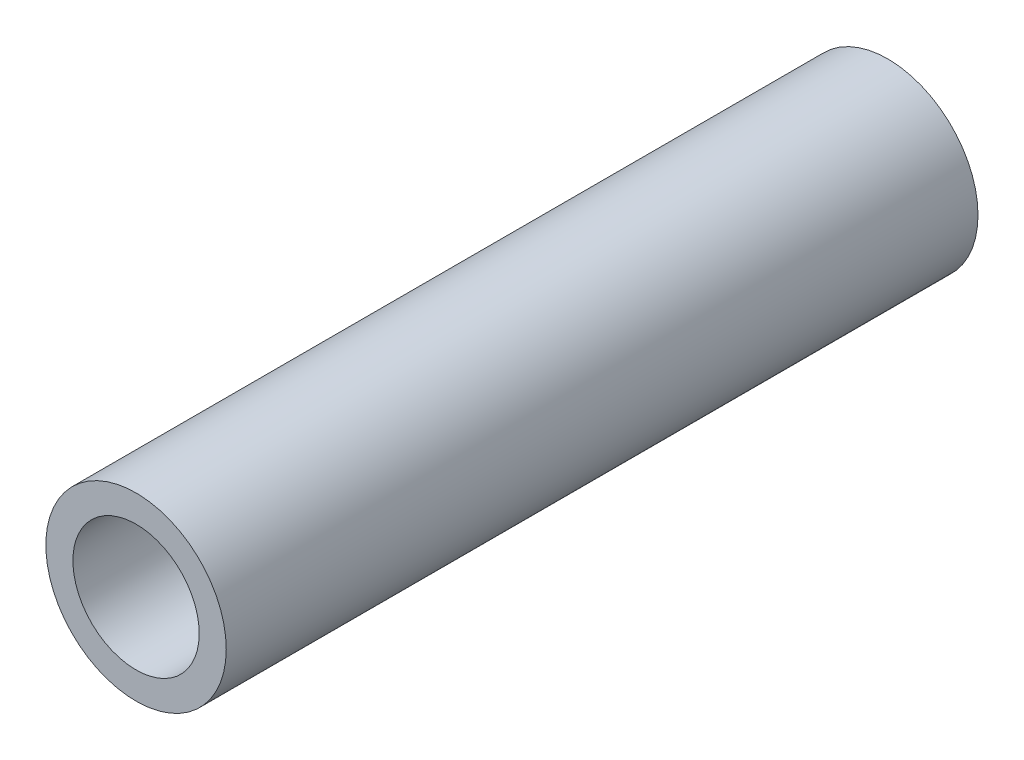
ISO-10303-21;
HEADER;
FILE_DESCRIPTION(('STEP AP214'),'2;1');
FILE_NAME('part.step','',(''),(''),'','','');
FILE_SCHEMA(('AUTOMOTIVE_DESIGN { 1 0 10303 214 1 1 1 1 }'));
ENDSEC;
DATA;
#1=APPLICATION_CONTEXT('core data for automotive mechanical design processes');
#2=APPLICATION_PROTOCOL_DEFINITION('international standard','automotive_design',2000,#1);
#3=PRODUCT_CONTEXT('',#1,'mechanical');
#4=PRODUCT('Part','Part','',(#3));
#5=PRODUCT_RELATED_PRODUCT_CATEGORY('part','',(#4));
#6=PRODUCT_DEFINITION_FORMATION('','',#4);
#7=PRODUCT_DEFINITION_CONTEXT('part definition',#1,'design');
#8=PRODUCT_DEFINITION('design','',#6,#7);
#9=PRODUCT_DEFINITION_SHAPE('','',#8);
#10=(LENGTH_UNIT() NAMED_UNIT(*) SI_UNIT(.MILLI.,.METRE.));
#11=(NAMED_UNIT(*) PLANE_ANGLE_UNIT() SI_UNIT($,.RADIAN.));
#12=(NAMED_UNIT(*) SI_UNIT($,.STERADIAN.) SOLID_ANGLE_UNIT());
#13=UNCERTAINTY_MEASURE_WITH_UNIT(LENGTH_MEASURE(1.E-05),#10,'distance_accuracy_value','');
#14=(GEOMETRIC_REPRESENTATION_CONTEXT(3) GLOBAL_UNCERTAINTY_ASSIGNED_CONTEXT((#13)) GLOBAL_UNIT_ASSIGNED_CONTEXT((#10,
#11,#12)) REPRESENTATION_CONTEXT('',''));
#15=CARTESIAN_POINT('',(0.,0.,0.));
#16=DIRECTION('',(0.,0.,1.));
#17=DIRECTION('',(1.,0.,0.));
#18=AXIS2_PLACEMENT_3D('',#15,#16,#17);
#19=CARTESIAN_POINT('',(0.,0.,0.));
#20=DIRECTION('',(0.,0.,1.));
#21=DIRECTION('',(-1.,0.,0.));
#22=AXIS2_PLACEMENT_3D('',#19,#20,#21);
#23=CYLINDRICAL_SURFACE('',#22,2.1);
#24=CARTESIAN_POINT('',(0.,0.,0.));
#25=DIRECTION('',(0.,0.,1.));
#26=DIRECTION('',(-1.,0.,0.));
#27=AXIS2_PLACEMENT_3D('',#24,#25,#26);
#28=CIRCLE('',#27,2.1);
#29=CARTESIAN_POINT('',(2.1,0.,0.));
#30=VERTEX_POINT('',#29);
#31=EDGE_CURVE('E39',#30,#30,#28,.T.);
#32=ORIENTED_EDGE('',*,*,#31,.F.);
#33=DIRECTION('',(0.,0.,1.));
#34=VECTOR('',#33,1.);
#35=CARTESIAN_POINT('',(2.1,0.,0.));
#36=LINE('',#35,#34);
#37=CARTESIAN_POINT('',(2.1,0.,25.));
#38=VERTEX_POINT('',#37);
#39=EDGE_CURVE('E10',#30,#38,#36,.T.);
#40=ORIENTED_EDGE('',*,*,#39,.T.);
#41=CARTESIAN_POINT('',(0.,0.,25.));
#42=DIRECTION('',(0.,0.,-1.));
#43=DIRECTION('',(-1.,0.,0.));
#44=AXIS2_PLACEMENT_3D('',#41,#42,#43);
#45=CIRCLE('',#44,2.1);
#46=EDGE_CURVE('E58',#38,#38,#45,.T.);
#47=ORIENTED_EDGE('',*,*,#46,.F.);
#48=ORIENTED_EDGE('',*,*,#39,.F.);
#49=EDGE_LOOP('',(#32,#40,#47,#48));
#50=FACE_BOUND('',#49,.T.);
#51=ADVANCED_FACE('F16',(#50),#23,.F.);
#52=CARTESIAN_POINT('',(0.,0.,0.));
#53=DIRECTION('',(0.,0.,1.));
#54=DIRECTION('',(-1.,0.,0.));
#55=AXIS2_PLACEMENT_3D('',#52,#53,#54);
#56=CYLINDRICAL_SURFACE('',#55,3.);
#57=CARTESIAN_POINT('',(0.,0.,25.));
#58=DIRECTION('',(0.,0.,1.));
#59=DIRECTION('',(-1.,0.,0.));
#60=AXIS2_PLACEMENT_3D('',#57,#58,#59);
#61=CIRCLE('',#60,3.);
#62=CARTESIAN_POINT('',(3.,0.,25.));
#63=VERTEX_POINT('',#62);
#64=EDGE_CURVE('E53',#63,#63,#61,.T.);
#65=ORIENTED_EDGE('',*,*,#64,.F.);
#66=DIRECTION('',(0.,0.,-1.));
#67=VECTOR('',#66,1.);
#68=CARTESIAN_POINT('',(3.,0.,0.));
#69=LINE('',#68,#67);
#70=CARTESIAN_POINT('',(3.,0.,0.));
#71=VERTEX_POINT('',#70);
#72=EDGE_CURVE('E27',#63,#71,#69,.T.);
#73=ORIENTED_EDGE('',*,*,#72,.T.);
#74=CARTESIAN_POINT('',(0.,0.,0.));
#75=DIRECTION('',(0.,0.,-1.));
#76=DIRECTION('',(-1.,0.,0.));
#77=AXIS2_PLACEMENT_3D('',#74,#75,#76);
#78=CIRCLE('',#77,3.);
#79=EDGE_CURVE('E20',#71,#71,#78,.T.);
#80=ORIENTED_EDGE('',*,*,#79,.F.);
#81=ORIENTED_EDGE('',*,*,#72,.F.);
#82=EDGE_LOOP('',(#65,#73,#80,#81));
#83=FACE_BOUND('',#82,.T.);
#84=ADVANCED_FACE('F54',(#83),#56,.T.);
#85=CARTESIAN_POINT('',(0.,0.,0.));
#86=DIRECTION('',(0.,0.,1.));
#87=DIRECTION('',(1.,0.,0.));
#88=AXIS2_PLACEMENT_3D('',#85,#86,#87);
#89=PLANE('',#88);
#90=ORIENTED_EDGE('',*,*,#79,.T.);
#91=EDGE_LOOP('',(#90));
#92=FACE_BOUND('',#91,.T.);
#93=ORIENTED_EDGE('',*,*,#31,.T.);
#94=EDGE_LOOP('',(#93));
#95=FACE_BOUND('',#94,.T.);
#96=ADVANCED_FACE('F18',(#92,#95),#89,.F.);
#97=CARTESIAN_POINT('',(0.,0.,25.));
#98=DIRECTION('',(0.,0.,1.));
#99=DIRECTION('',(1.,0.,0.));
#100=AXIS2_PLACEMENT_3D('',#97,#98,#99);
#101=PLANE('',#100);
#102=ORIENTED_EDGE('',*,*,#64,.T.);
#103=EDGE_LOOP('',(#102));
#104=FACE_BOUND('',#103,.T.);
#105=ORIENTED_EDGE('',*,*,#46,.T.);
#106=EDGE_LOOP('',(#105));
#107=FACE_BOUND('',#106,.T.);
#108=ADVANCED_FACE('F77',(#104,#107),#101,.T.);
#109=CLOSED_SHELL('',(#51,#84,#96,#108));
#110=MANIFOLD_SOLID_BREP('B1',#109);
#111=ADVANCED_BREP_SHAPE_REPRESENTATION('',(#18,#110),#14);
#112=SHAPE_DEFINITION_REPRESENTATION(#9,#111);
ENDSEC;
END-ISO-10303-21;
